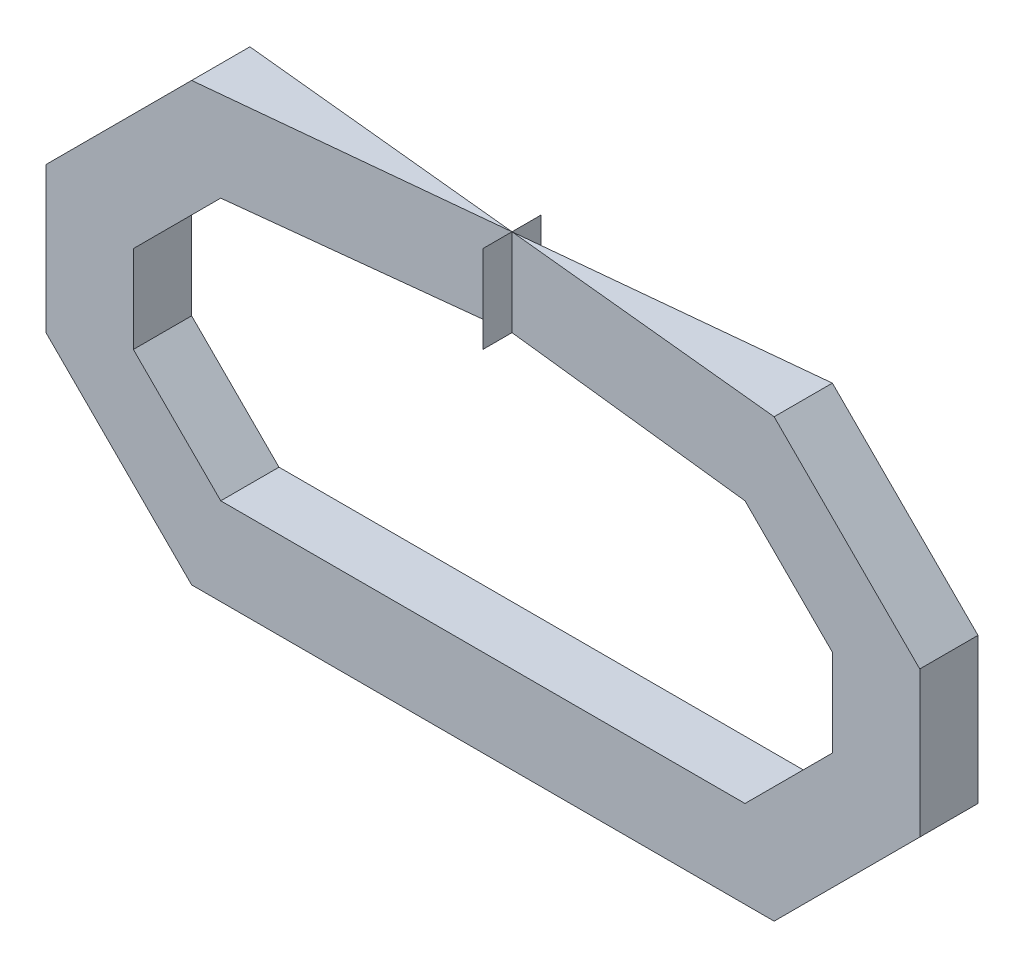
ISO-10303-21;
HEADER;
FILE_DESCRIPTION(('STEP AP214'),'2;1');
FILE_NAME('part.step','',(''),(''),'','','');
FILE_SCHEMA(('AUTOMOTIVE_DESIGN { 1 0 10303 214 1 1 1 1 }'));
ENDSEC;
DATA;
#1=APPLICATION_CONTEXT('core data for automotive mechanical design processes');
#2=APPLICATION_PROTOCOL_DEFINITION('international standard','automotive_design',2000,#1);
#3=PRODUCT_CONTEXT('',#1,'mechanical');
#4=PRODUCT('Part','Part','',(#3));
#5=PRODUCT_RELATED_PRODUCT_CATEGORY('part','',(#4));
#6=PRODUCT_DEFINITION_FORMATION('','',#4);
#7=PRODUCT_DEFINITION_CONTEXT('part definition',#1,'design');
#8=PRODUCT_DEFINITION('design','',#6,#7);
#9=PRODUCT_DEFINITION_SHAPE('','',#8);
#10=(LENGTH_UNIT() NAMED_UNIT(*) SI_UNIT(.MILLI.,.METRE.));
#11=(NAMED_UNIT(*) PLANE_ANGLE_UNIT() SI_UNIT($,.RADIAN.));
#12=(NAMED_UNIT(*) SI_UNIT($,.STERADIAN.) SOLID_ANGLE_UNIT());
#13=UNCERTAINTY_MEASURE_WITH_UNIT(LENGTH_MEASURE(1.E-05),#10,'distance_accuracy_value','');
#14=(GEOMETRIC_REPRESENTATION_CONTEXT(3) GLOBAL_UNCERTAINTY_ASSIGNED_CONTEXT((#13)) GLOBAL_UNIT_ASSIGNED_CONTEXT((#10,
#11,#12)) REPRESENTATION_CONTEXT('',''));
#15=CARTESIAN_POINT('',(0.,0.,0.));
#16=DIRECTION('',(0.,0.,1.));
#17=DIRECTION('',(1.,0.,0.));
#18=AXIS2_PLACEMENT_3D('',#15,#16,#17);
#19=CARTESIAN_POINT('',(-0.127,-0.09524999999999,0.0254));
#20=DIRECTION('',(0.,0.,1.));
#21=DIRECTION('',(1.,0.,0.));
#22=AXIS2_PLACEMENT_3D('',#19,#20,#21);
#23=PLANE('',#22);
#24=DIRECTION('',(0.,1.,0.));
#25=VECTOR('',#24,1.);
#26=CARTESIAN_POINT('',(0.1905,0.03175000000002,0.0254));
#27=LINE('',#26,#25);
#28=CARTESIAN_POINT('',(0.1905,0.03175000000002,0.0254));
#29=VERTEX_POINT('',#28);
#30=CARTESIAN_POINT('',(0.1905,-0.03174999999999,0.0254));
#31=VERTEX_POINT('',#30);
#32=EDGE_CURVE('P0_E218',#29,#31,#27,.F.);
#33=ORIENTED_EDGE('',*,*,#32,.F.);
#34=DIRECTION('',(-0.707106781186548,0.707106781186548,0.));
#35=VECTOR('',#34,1.);
#36=CARTESIAN_POINT('',(0.127,0.09525000000002,0.0254));
#37=LINE('',#36,#35);
#38=CARTESIAN_POINT('',(0.127,0.09525000000002,0.0254));
#39=VERTEX_POINT('',#38);
#40=EDGE_CURVE('P0_E215',#39,#29,#37,.F.);
#41=ORIENTED_EDGE('',*,*,#40,.F.);
#42=DIRECTION('',(1.,0.,0.));
#43=VECTOR('',#42,1.);
#44=CARTESIAN_POINT('',(0.,0.09525000000002,0.0254));
#45=LINE('',#44,#43);
#46=CARTESIAN_POINT('',(0.,0.09525000000002,0.0127));
#47=VERTEX_POINT('',#46);
#48=EDGE_CURVE('P0_E239',#47,#39,#45,.T.);
#49=ORIENTED_EDGE('',*,*,#48,.F.);
#50=DIRECTION('',(1.,0.,0.));
#51=VECTOR('',#50,1.);
#52=CARTESIAN_POINT('',(-0.127,0.09525000000002,0.0254));
#53=LINE('',#52,#51);
#54=CARTESIAN_POINT('',(-0.127,0.09525000000002,0.0254));
#55=VERTEX_POINT('',#54);
#56=EDGE_CURVE('P0_E236',#55,#47,#53,.T.);
#57=ORIENTED_EDGE('',*,*,#56,.F.);
#58=DIRECTION('',(-0.707106781186548,-0.707106781186548,0.));
#59=VECTOR('',#58,1.);
#60=CARTESIAN_POINT('',(-0.1905,0.03175000000002,0.0254));
#61=LINE('',#60,#59);
#62=CARTESIAN_POINT('',(-0.1905,0.03175000000002,0.0254));
#63=VERTEX_POINT('',#62);
#64=EDGE_CURVE('P0_E234',#63,#55,#61,.F.);
#65=ORIENTED_EDGE('',*,*,#64,.F.);
#66=DIRECTION('',(0.,1.,0.));
#67=VECTOR('',#66,1.);
#68=CARTESIAN_POINT('',(-0.1905,-0.03174999999999,0.0254));
#69=LINE('',#68,#67);
#70=CARTESIAN_POINT('',(-0.1905,-0.03174999999999,0.0254));
#71=VERTEX_POINT('',#70);
#72=EDGE_CURVE('P0_E231',#71,#63,#69,.T.);
#73=ORIENTED_EDGE('',*,*,#72,.F.);
#74=DIRECTION('',(0.707106781186548,-0.707106781186548,0.));
#75=VECTOR('',#74,1.);
#76=CARTESIAN_POINT('',(-0.127,-0.09524999999999,0.0254));
#77=LINE('',#76,#75);
#78=CARTESIAN_POINT('',(-0.127,-0.09524999999999,0.0254));
#79=VERTEX_POINT('',#78);
#80=EDGE_CURVE('P0_E228',#79,#71,#77,.F.);
#81=ORIENTED_EDGE('',*,*,#80,.F.);
#82=DIRECTION('',(1.,0.,0.));
#83=VECTOR('',#82,1.);
#84=CARTESIAN_POINT('',(0.127,-0.09524999999999,0.0254));
#85=LINE('',#84,#83);
#86=CARTESIAN_POINT('',(0.127,-0.09524999999999,0.0254));
#87=VERTEX_POINT('',#86);
#88=EDGE_CURVE('P0_E225',#87,#79,#85,.F.);
#89=ORIENTED_EDGE('',*,*,#88,.F.);
#90=DIRECTION('',(0.707106781186548,0.707106781186548,0.));
#91=VECTOR('',#90,1.);
#92=CARTESIAN_POINT('',(0.1905,-0.03174999999999,0.0254));
#93=LINE('',#92,#91);
#94=EDGE_CURVE('P0_E222',#31,#87,#93,.F.);
#95=ORIENTED_EDGE('',*,*,#94,.F.);
#96=EDGE_LOOP('',(#33,#41,#49,#57,#65,#73,#81,#89,#95));
#97=FACE_BOUND('',#96,.T.);
#98=DIRECTION('',(0.707106781187048,0.707106781186048,0.));
#99=VECTOR('',#98,1.);
#100=CARTESIAN_POINT('',(-0.1143,0.05715000000001,0.0254));
#101=LINE('',#100,#99);
#102=CARTESIAN_POINT('',(-0.1143,0.05715000000001,0.0254));
#103=VERTEX_POINT('',#102);
#104=CARTESIAN_POINT('',(-0.152400000000011,0.0190500000000529,0.0254));
#105=VERTEX_POINT('',#104);
#106=EDGE_CURVE('P0_E250',#103,#105,#101,.F.);
#107=ORIENTED_EDGE('',*,*,#106,.F.);
#108=DIRECTION('',(1.,0.,0.));
#109=VECTOR('',#108,1.);
#110=CARTESIAN_POINT('',(0.,0.05715000000001,0.0254));
#111=LINE('',#110,#109);
#112=CARTESIAN_POINT('',(0.,0.05715000000001,0.0127));
#113=VERTEX_POINT('',#112);
#114=EDGE_CURVE('P0_E149',#113,#103,#111,.F.);
#115=ORIENTED_EDGE('',*,*,#114,.F.);
#116=DIRECTION('',(1.,0.,0.));
#117=VECTOR('',#116,1.);
#118=CARTESIAN_POINT('',(0.1143,0.05715000000001,0.0254));
#119=LINE('',#118,#117);
#120=CARTESIAN_POINT('',(0.114299999999967,0.057149999999999,0.0254));
#121=VERTEX_POINT('',#120);
#122=EDGE_CURVE('P0_E144',#121,#113,#119,.F.);
#123=ORIENTED_EDGE('',*,*,#122,.F.);
#124=DIRECTION('',(0.707106781187048,-0.707106781186048,0.));
#125=VECTOR('',#124,1.);
#126=CARTESIAN_POINT('',(0.1524,0.01905000000002,0.0254));
#127=LINE('',#126,#125);
#128=CARTESIAN_POINT('',(0.1524,0.01905000000002,0.0254));
#129=VERTEX_POINT('',#128);
#130=EDGE_CURVE('P0_E135',#129,#121,#127,.F.);
#131=ORIENTED_EDGE('',*,*,#130,.F.);
#132=DIRECTION('',(0.,1.,0.));
#133=VECTOR('',#132,1.);
#134=CARTESIAN_POINT('',(0.1524,-0.01904999999999,0.0254));
#135=LINE('',#134,#133);
#136=CARTESIAN_POINT('',(0.152400000000011,-0.0190500000000229,0.0254));
#137=VERTEX_POINT('',#136);
#138=EDGE_CURVE('P0_E130',#137,#129,#135,.T.);
#139=ORIENTED_EDGE('',*,*,#138,.F.);
#140=DIRECTION('',(-0.707106781187048,-0.707106781186048,0.));
#141=VECTOR('',#140,1.);
#142=CARTESIAN_POINT('',(0.1143,-0.05714999999998,0.0254));
#143=LINE('',#142,#141);
#144=CARTESIAN_POINT('',(0.1143,-0.05714999999998,0.0254));
#145=VERTEX_POINT('',#144);
#146=EDGE_CURVE('P0_E262',#145,#137,#143,.F.);
#147=ORIENTED_EDGE('',*,*,#146,.F.);
#148=DIRECTION('',(1.,0.,0.));
#149=VECTOR('',#148,1.);
#150=CARTESIAN_POINT('',(-0.1143,-0.05714999999998,0.0254));
#151=LINE('',#150,#149);
#152=CARTESIAN_POINT('',(-0.114299999999967,-0.057149999999969,0.0254));
#153=VERTEX_POINT('',#152);
#154=EDGE_CURVE('P0_E259',#153,#145,#151,.T.);
#155=ORIENTED_EDGE('',*,*,#154,.F.);
#156=DIRECTION('',(-0.707106781187048,0.707106781186048,0.));
#157=VECTOR('',#156,1.);
#158=CARTESIAN_POINT('',(-0.1524,-0.01904999999999,0.0254));
#159=LINE('',#158,#157);
#160=CARTESIAN_POINT('',(-0.1524,-0.01904999999999,0.0254));
#161=VERTEX_POINT('',#160);
#162=EDGE_CURVE('P0_E256',#161,#153,#159,.F.);
#163=ORIENTED_EDGE('',*,*,#162,.F.);
#164=DIRECTION('',(0.,1.,0.));
#165=VECTOR('',#164,1.);
#166=CARTESIAN_POINT('',(-0.1524,0.01905000000002,0.0254));
#167=LINE('',#166,#165);
#168=EDGE_CURVE('P0_E253',#105,#161,#167,.F.);
#169=ORIENTED_EDGE('',*,*,#168,.F.);
#170=EDGE_LOOP('',(#107,#115,#123,#131,#139,#147,#155,#163,#169));
#171=FACE_BOUND('',#170,.T.);
#172=ADVANCED_FACE('P0_F17',(#97,#171),#23,.T.);
#173=CARTESIAN_POINT('',(0.1143,0.05715000000001,0.));
#174=DIRECTION('',(0.,-1.,0.));
#175=DIRECTION('',(0.,0.,-1.));
#176=AXIS2_PLACEMENT_3D('',#173,#174,#175);
#177=PLANE('',#176);
#178=DIRECTION('',(1.,0.,0.));
#179=VECTOR('',#178,1.);
#180=CARTESIAN_POINT('',(0.1143,0.05715000000001,0.));
#181=LINE('',#180,#179);
#182=CARTESIAN_POINT('',(0.114299999999967,0.057149999999999,0.));
#183=VERTEX_POINT('',#182);
#184=EDGE_CURVE('P0_E154',#113,#183,#181,.T.);
#185=ORIENTED_EDGE('',*,*,#184,.T.);
#186=DIRECTION('',(0.,0.,1.));
#187=VECTOR('',#186,1.);
#188=CARTESIAN_POINT('',(0.114299999999978,0.0571499999999881,0.));
#189=LINE('',#188,#187);
#190=EDGE_CURVE('P0_E140',#121,#183,#189,.F.);
#191=ORIENTED_EDGE('',*,*,#190,.F.);
#192=ORIENTED_EDGE('',*,*,#122,.T.);
#193=EDGE_LOOP('',(#185,#191,#192));
#194=FACE_BOUND('',#193,.T.);
#195=ADVANCED_FACE('P0_F153',(#194),#177,.T.);
#196=CARTESIAN_POINT('',(0.1524,0.01905000000002,0.));
#197=DIRECTION('',(-0.707106781186048,-0.707106781187048,0.));
#198=DIRECTION('',(0.707106781187048,-0.707106781186048,0.));
#199=AXIS2_PLACEMENT_3D('',#196,#197,#198);
#200=PLANE('',#199);
#201=ORIENTED_EDGE('',*,*,#190,.T.);
#202=DIRECTION('',(0.707106781187048,-0.707106781186048,0.));
#203=VECTOR('',#202,1.);
#204=CARTESIAN_POINT('',(0.1524,0.01905000000002,0.));
#205=LINE('',#204,#203);
#206=CARTESIAN_POINT('',(0.1524,0.01905000000002,0.));
#207=VERTEX_POINT('',#206);
#208=EDGE_CURVE('P0_E210',#183,#207,#205,.T.);
#209=ORIENTED_EDGE('',*,*,#208,.T.);
#210=DIRECTION('',(0.,0.,1.));
#211=VECTOR('',#210,1.);
#212=CARTESIAN_POINT('',(0.1524,0.01905000000002,0.));
#213=LINE('',#212,#211);
#214=EDGE_CURVE('P0_E142',#129,#207,#213,.F.);
#215=ORIENTED_EDGE('',*,*,#214,.F.);
#216=ORIENTED_EDGE('',*,*,#130,.T.);
#217=EDGE_LOOP('',(#201,#209,#215,#216));
#218=FACE_BOUND('',#217,.T.);
#219=ADVANCED_FACE('P0_F137',(#218),#200,.T.);
#220=CARTESIAN_POINT('',(0.1524,-0.01904999999999,0.));
#221=DIRECTION('',(-1.,0.,0.));
#222=DIRECTION('',(0.,0.,1.));
#223=AXIS2_PLACEMENT_3D('',#220,#221,#222);
#224=PLANE('',#223);
#225=ORIENTED_EDGE('',*,*,#214,.T.);
#226=DIRECTION('',(0.,1.,0.));
#227=VECTOR('',#226,1.);
#228=CARTESIAN_POINT('',(0.1524,-0.01904999999999,0.));
#229=LINE('',#228,#227);
#230=CARTESIAN_POINT('',(0.152400000000011,-0.0190500000000229,0.));
#231=VERTEX_POINT('',#230);
#232=EDGE_CURVE('P0_E207',#207,#231,#229,.F.);
#233=ORIENTED_EDGE('',*,*,#232,.T.);
#234=DIRECTION('',(0.,0.,1.));
#235=VECTOR('',#234,1.);
#236=CARTESIAN_POINT('',(0.152400000000022,-0.0190500000000119,0.));
#237=LINE('',#236,#235);
#238=EDGE_CURVE('P0_E261',#137,#231,#237,.F.);
#239=ORIENTED_EDGE('',*,*,#238,.F.);
#240=ORIENTED_EDGE('',*,*,#138,.T.);
#241=EDGE_LOOP('',(#225,#233,#239,#240));
#242=FACE_BOUND('',#241,.T.);
#243=ADVANCED_FACE('P0_F267',(#242),#224,.T.);
#244=CARTESIAN_POINT('',(0.1143,-0.05714999999998,0.));
#245=DIRECTION('',(-0.707106781186048,0.707106781187048,0.));
#246=DIRECTION('',(-0.707106781187048,-0.707106781186048,0.));
#247=AXIS2_PLACEMENT_3D('',#244,#245,#246);
#248=PLANE('',#247);
#249=ORIENTED_EDGE('',*,*,#238,.T.);
#250=DIRECTION('',(-0.707106781187048,-0.707106781186048,0.));
#251=VECTOR('',#250,1.);
#252=CARTESIAN_POINT('',(0.1143,-0.05714999999998,0.));
#253=LINE('',#252,#251);
#254=CARTESIAN_POINT('',(0.1143,-0.05714999999998,0.));
#255=VERTEX_POINT('',#254);
#256=EDGE_CURVE('P0_E204',#231,#255,#253,.T.);
#257=ORIENTED_EDGE('',*,*,#256,.T.);
#258=DIRECTION('',(0.,0.,1.));
#259=VECTOR('',#258,1.);
#260=CARTESIAN_POINT('',(0.1143,-0.05714999999998,0.));
#261=LINE('',#260,#259);
#262=EDGE_CURVE('P0_E258',#145,#255,#261,.F.);
#263=ORIENTED_EDGE('',*,*,#262,.F.);
#264=ORIENTED_EDGE('',*,*,#146,.T.);
#265=EDGE_LOOP('',(#249,#257,#263,#264));
#266=FACE_BOUND('',#265,.T.);
#267=ADVANCED_FACE('P0_F274',(#266),#248,.T.);
#268=CARTESIAN_POINT('',(-0.1143,-0.05714999999998,0.));
#269=DIRECTION('',(0.,1.,0.));
#270=DIRECTION('',(0.,0.,1.));
#271=AXIS2_PLACEMENT_3D('',#268,#269,#270);
#272=PLANE('',#271);
#273=ORIENTED_EDGE('',*,*,#262,.T.);
#274=DIRECTION('',(1.,0.,0.));
#275=VECTOR('',#274,1.);
#276=CARTESIAN_POINT('',(-0.1143,-0.05714999999998,0.));
#277=LINE('',#276,#275);
#278=CARTESIAN_POINT('',(-0.114299999999967,-0.057149999999969,0.));
#279=VERTEX_POINT('',#278);
#280=EDGE_CURVE('P0_E201',#255,#279,#277,.F.);
#281=ORIENTED_EDGE('',*,*,#280,.T.);
#282=DIRECTION('',(0.,0.,1.));
#283=VECTOR('',#282,1.);
#284=CARTESIAN_POINT('',(-0.114299999999978,-0.0571499999999581,0.));
#285=LINE('',#284,#283);
#286=EDGE_CURVE('P0_E255',#153,#279,#285,.F.);
#287=ORIENTED_EDGE('',*,*,#286,.F.);
#288=ORIENTED_EDGE('',*,*,#154,.T.);
#289=EDGE_LOOP('',(#273,#281,#287,#288));
#290=FACE_BOUND('',#289,.T.);
#291=ADVANCED_FACE('P0_F454',(#290),#272,.T.);
#292=CARTESIAN_POINT('',(-0.1524,-0.01904999999999,0.));
#293=DIRECTION('',(0.707106781186048,0.707106781187048,0.));
#294=DIRECTION('',(-0.707106781187048,0.707106781186048,0.));
#295=AXIS2_PLACEMENT_3D('',#292,#293,#294);
#296=PLANE('',#295);
#297=ORIENTED_EDGE('',*,*,#286,.T.);
#298=DIRECTION('',(-0.707106781187048,0.707106781186048,0.));
#299=VECTOR('',#298,1.);
#300=CARTESIAN_POINT('',(-0.1524,-0.01904999999999,0.));
#301=LINE('',#300,#299);
#302=CARTESIAN_POINT('',(-0.1524,-0.01904999999999,0.));
#303=VERTEX_POINT('',#302);
#304=EDGE_CURVE('P0_E198',#279,#303,#301,.T.);
#305=ORIENTED_EDGE('',*,*,#304,.T.);
#306=DIRECTION('',(0.,0.,-1.));
#307=VECTOR('',#306,1.);
#308=CARTESIAN_POINT('',(-0.1524,-0.01904999999999,0.));
#309=LINE('',#308,#307);
#310=EDGE_CURVE('P0_E252',#161,#303,#309,.T.);
#311=ORIENTED_EDGE('',*,*,#310,.F.);
#312=ORIENTED_EDGE('',*,*,#162,.T.);
#313=EDGE_LOOP('',(#297,#305,#311,#312));
#314=FACE_BOUND('',#313,.T.);
#315=ADVANCED_FACE('P0_F445',(#314),#296,.T.);
#316=CARTESIAN_POINT('',(-0.1524,0.01905000000002,0.));
#317=DIRECTION('',(1.,0.,0.));
#318=DIRECTION('',(0.,0.,-1.));
#319=AXIS2_PLACEMENT_3D('',#316,#317,#318);
#320=PLANE('',#319);
#321=ORIENTED_EDGE('',*,*,#310,.T.);
#322=DIRECTION('',(0.,1.,0.));
#323=VECTOR('',#322,1.);
#324=CARTESIAN_POINT('',(-0.1524,0.01905000000002,0.));
#325=LINE('',#324,#323);
#326=CARTESIAN_POINT('',(-0.152400000000011,0.0190500000000529,0.));
#327=VERTEX_POINT('',#326);
#328=EDGE_CURVE('P0_E195',#303,#327,#325,.T.);
#329=ORIENTED_EDGE('',*,*,#328,.T.);
#330=DIRECTION('',(0.,0.,1.));
#331=VECTOR('',#330,1.);
#332=CARTESIAN_POINT('',(-0.152400000000022,0.0190500000000419,0.));
#333=LINE('',#332,#331);
#334=EDGE_CURVE('P0_E247',#105,#327,#333,.F.);
#335=ORIENTED_EDGE('',*,*,#334,.F.);
#336=ORIENTED_EDGE('',*,*,#168,.T.);
#337=EDGE_LOOP('',(#321,#329,#335,#336));
#338=FACE_BOUND('',#337,.T.);
#339=ADVANCED_FACE('P0_F436',(#338),#320,.T.);
#340=CARTESIAN_POINT('',(-0.1143,0.05715000000001,0.));
#341=DIRECTION('',(0.707106781186048,-0.707106781187048,0.));
#342=DIRECTION('',(0.707106781187048,0.707106781186048,0.));
#343=AXIS2_PLACEMENT_3D('',#340,#341,#342);
#344=PLANE('',#343);
#345=ORIENTED_EDGE('',*,*,#334,.T.);
#346=DIRECTION('',(0.707106781187048,0.707106781186048,0.));
#347=VECTOR('',#346,1.);
#348=CARTESIAN_POINT('',(-0.1143,0.05715000000001,0.));
#349=LINE('',#348,#347);
#350=CARTESIAN_POINT('',(-0.1143,0.05715000000001,0.));
#351=VERTEX_POINT('',#350);
#352=EDGE_CURVE('P0_E190',#327,#351,#349,.T.);
#353=ORIENTED_EDGE('',*,*,#352,.T.);
#354=DIRECTION('',(0.,0.,-1.));
#355=VECTOR('',#354,1.);
#356=CARTESIAN_POINT('',(-0.1143,0.05715000000001,0.));
#357=LINE('',#356,#355);
#358=EDGE_CURVE('P0_E243',#103,#351,#357,.T.);
#359=ORIENTED_EDGE('',*,*,#358,.F.);
#360=ORIENTED_EDGE('',*,*,#106,.T.);
#361=EDGE_LOOP('',(#345,#353,#359,#360));
#362=FACE_BOUND('',#361,.T.);
#363=ADVANCED_FACE('P0_F341',(#362),#344,.T.);
#364=CARTESIAN_POINT('',(0.,0.05715000000001,0.));
#365=DIRECTION('',(0.,-1.,0.));
#366=DIRECTION('',(0.,0.,-1.));
#367=AXIS2_PLACEMENT_3D('',#364,#365,#366);
#368=PLANE('',#367);
#369=ORIENTED_EDGE('',*,*,#358,.T.);
#370=DIRECTION('',(1.,0.,0.));
#371=VECTOR('',#370,1.);
#372=CARTESIAN_POINT('',(0.,0.05715000000001,0.));
#373=LINE('',#372,#371);
#374=EDGE_CURVE('P0_E185',#351,#113,#373,.T.);
#375=ORIENTED_EDGE('',*,*,#374,.T.);
#376=ORIENTED_EDGE('',*,*,#114,.T.);
#377=EDGE_LOOP('',(#369,#375,#376));
#378=FACE_BOUND('',#377,.T.);
#379=ADVANCED_FACE('P0_F333',(#378),#368,.T.);
#380=CARTESIAN_POINT('',(0.,0.09525000000002,0.));
#381=DIRECTION('',(0.,1.,0.));
#382=DIRECTION('',(0.,0.,1.));
#383=AXIS2_PLACEMENT_3D('',#380,#381,#382);
#384=PLANE('',#383);
#385=DIRECTION('',(0.,0.,1.));
#386=VECTOR('',#385,1.);
#387=CARTESIAN_POINT('',(0.127,0.09525000000002,0.));
#388=LINE('',#387,#386);
#389=CARTESIAN_POINT('',(0.127,0.09525000000002,0.));
#390=VERTEX_POINT('',#389);
#391=EDGE_CURVE('P0_E217',#390,#39,#388,.T.);
#392=ORIENTED_EDGE('',*,*,#391,.F.);
#393=DIRECTION('',(1.,0.,0.));
#394=VECTOR('',#393,1.);
#395=CARTESIAN_POINT('',(0.,0.09525000000002,0.));
#396=LINE('',#395,#394);
#397=EDGE_CURVE('P0_E180',#390,#47,#396,.F.);
#398=ORIENTED_EDGE('',*,*,#397,.T.);
#399=ORIENTED_EDGE('',*,*,#48,.T.);
#400=EDGE_LOOP('',(#392,#398,#399));
#401=FACE_BOUND('',#400,.T.);
#402=ADVANCED_FACE('P0_F331',(#401),#384,.T.);
#403=CARTESIAN_POINT('',(-0.127,0.09525000000002,0.));
#404=DIRECTION('',(0.,1.,0.));
#405=DIRECTION('',(0.,0.,1.));
#406=AXIS2_PLACEMENT_3D('',#403,#404,#405);
#407=PLANE('',#406);
#408=DIRECTION('',(1.,0.,0.));
#409=VECTOR('',#408,1.);
#410=CARTESIAN_POINT('',(-0.127,0.09525000000002,0.));
#411=LINE('',#410,#409);
#412=CARTESIAN_POINT('',(-0.127,0.09525000000002,0.));
#413=VERTEX_POINT('',#412);
#414=EDGE_CURVE('P0_E177',#47,#413,#411,.F.);
#415=ORIENTED_EDGE('',*,*,#414,.T.);
#416=DIRECTION('',(0.,0.,1.));
#417=VECTOR('',#416,1.);
#418=CARTESIAN_POINT('',(-0.127,0.09525000000002,0.));
#419=LINE('',#418,#417);
#420=EDGE_CURVE('P0_E233',#55,#413,#419,.F.);
#421=ORIENTED_EDGE('',*,*,#420,.F.);
#422=ORIENTED_EDGE('',*,*,#56,.T.);
#423=EDGE_LOOP('',(#415,#421,#422));
#424=FACE_BOUND('',#423,.T.);
#425=ADVANCED_FACE('P0_F330',(#424),#407,.T.);
#426=CARTESIAN_POINT('',(-0.1905,0.03175000000002,0.));
#427=DIRECTION('',(-0.707106781186548,0.707106781186548,0.));
#428=DIRECTION('',(-0.707106781186548,-0.707106781186548,0.));
#429=AXIS2_PLACEMENT_3D('',#426,#427,#428);
#430=PLANE('',#429);
#431=ORIENTED_EDGE('',*,*,#420,.T.);
#432=DIRECTION('',(-0.707106781186548,-0.707106781186548,0.));
#433=VECTOR('',#432,1.);
#434=CARTESIAN_POINT('',(-0.1905,0.03175000000002,0.));
#435=LINE('',#434,#433);
#436=CARTESIAN_POINT('',(-0.1905,0.03175000000002,0.));
#437=VERTEX_POINT('',#436);
#438=EDGE_CURVE('P0_E174',#413,#437,#435,.T.);
#439=ORIENTED_EDGE('',*,*,#438,.T.);
#440=DIRECTION('',(0.,0.,1.));
#441=VECTOR('',#440,1.);
#442=CARTESIAN_POINT('',(-0.1905,0.03175000000002,0.));
#443=LINE('',#442,#441);
#444=EDGE_CURVE('P0_E230',#63,#437,#443,.F.);
#445=ORIENTED_EDGE('',*,*,#444,.F.);
#446=ORIENTED_EDGE('',*,*,#64,.T.);
#447=EDGE_LOOP('',(#431,#439,#445,#446));
#448=FACE_BOUND('',#447,.T.);
#449=ADVANCED_FACE('P0_F327',(#448),#430,.T.);
#450=CARTESIAN_POINT('',(-0.1905,-0.03174999999999,0.));
#451=DIRECTION('',(-1.,0.,0.));
#452=DIRECTION('',(0.,0.,1.));
#453=AXIS2_PLACEMENT_3D('',#450,#451,#452);
#454=PLANE('',#453);
#455=ORIENTED_EDGE('',*,*,#444,.T.);
#456=DIRECTION('',(0.,1.,0.));
#457=VECTOR('',#456,1.);
#458=CARTESIAN_POINT('',(-0.1905,-0.03174999999999,0.));
#459=LINE('',#458,#457);
#460=CARTESIAN_POINT('',(-0.1905,-0.03174999999999,0.));
#461=VERTEX_POINT('',#460);
#462=EDGE_CURVE('P0_E171',#437,#461,#459,.F.);
#463=ORIENTED_EDGE('',*,*,#462,.T.);
#464=DIRECTION('',(0.,0.,1.));
#465=VECTOR('',#464,1.);
#466=CARTESIAN_POINT('',(-0.1905,-0.03174999999999,0.));
#467=LINE('',#466,#465);
#468=EDGE_CURVE('P0_E227',#71,#461,#467,.F.);
#469=ORIENTED_EDGE('',*,*,#468,.F.);
#470=ORIENTED_EDGE('',*,*,#72,.T.);
#471=EDGE_LOOP('',(#455,#463,#469,#470));
#472=FACE_BOUND('',#471,.T.);
#473=ADVANCED_FACE('P0_F322',(#472),#454,.T.);
#474=CARTESIAN_POINT('',(-0.127,-0.09524999999999,0.));
#475=DIRECTION('',(-0.707106781186548,-0.707106781186548,0.));
#476=DIRECTION('',(0.707106781186548,-0.707106781186548,0.));
#477=AXIS2_PLACEMENT_3D('',#474,#475,#476);
#478=PLANE('',#477);
#479=ORIENTED_EDGE('',*,*,#468,.T.);
#480=DIRECTION('',(0.707106781186548,-0.707106781186548,0.));
#481=VECTOR('',#480,1.);
#482=CARTESIAN_POINT('',(-0.127,-0.09524999999999,0.));
#483=LINE('',#482,#481);
#484=CARTESIAN_POINT('',(-0.127,-0.09524999999999,0.));
#485=VERTEX_POINT('',#484);
#486=EDGE_CURVE('P0_E168',#461,#485,#483,.T.);
#487=ORIENTED_EDGE('',*,*,#486,.T.);
#488=DIRECTION('',(0.,0.,-1.));
#489=VECTOR('',#488,1.);
#490=CARTESIAN_POINT('',(-0.127,-0.09524999999999,0.));
#491=LINE('',#490,#489);
#492=EDGE_CURVE('P0_E224',#79,#485,#491,.T.);
#493=ORIENTED_EDGE('',*,*,#492,.F.);
#494=ORIENTED_EDGE('',*,*,#80,.T.);
#495=EDGE_LOOP('',(#479,#487,#493,#494));
#496=FACE_BOUND('',#495,.T.);
#497=ADVANCED_FACE('P0_F318',(#496),#478,.T.);
#498=CARTESIAN_POINT('',(0.127,-0.09524999999999,0.));
#499=DIRECTION('',(0.,-1.,0.));
#500=DIRECTION('',(0.,0.,-1.));
#501=AXIS2_PLACEMENT_3D('',#498,#499,#500);
#502=PLANE('',#501);
#503=ORIENTED_EDGE('',*,*,#492,.T.);
#504=DIRECTION('',(1.,0.,0.));
#505=VECTOR('',#504,1.);
#506=CARTESIAN_POINT('',(0.127,-0.09524999999999,0.));
#507=LINE('',#506,#505);
#508=CARTESIAN_POINT('',(0.127,-0.09524999999999,0.));
#509=VERTEX_POINT('',#508);
#510=EDGE_CURVE('P0_E165',#485,#509,#507,.T.);
#511=ORIENTED_EDGE('',*,*,#510,.T.);
#512=DIRECTION('',(0.,0.,1.));
#513=VECTOR('',#512,1.);
#514=CARTESIAN_POINT('',(0.127,-0.09524999999999,0.));
#515=LINE('',#514,#513);
#516=EDGE_CURVE('P0_E221',#87,#509,#515,.F.);
#517=ORIENTED_EDGE('',*,*,#516,.F.);
#518=ORIENTED_EDGE('',*,*,#88,.T.);
#519=EDGE_LOOP('',(#503,#511,#517,#518));
#520=FACE_BOUND('',#519,.T.);
#521=ADVANCED_FACE('P0_F312',(#520),#502,.T.);
#522=CARTESIAN_POINT('',(0.1905,-0.03174999999999,0.));
#523=DIRECTION('',(0.707106781186548,-0.707106781186548,0.));
#524=DIRECTION('',(0.707106781186548,0.707106781186548,0.));
#525=AXIS2_PLACEMENT_3D('',#522,#523,#524);
#526=PLANE('',#525);
#527=ORIENTED_EDGE('',*,*,#516,.T.);
#528=DIRECTION('',(0.707106781186548,0.707106781186548,0.));
#529=VECTOR('',#528,1.);
#530=CARTESIAN_POINT('',(0.1905,-0.03174999999999,0.));
#531=LINE('',#530,#529);
#532=CARTESIAN_POINT('',(0.1905,-0.03174999999999,0.));
#533=VERTEX_POINT('',#532);
#534=EDGE_CURVE('P0_E162',#509,#533,#531,.T.);
#535=ORIENTED_EDGE('',*,*,#534,.T.);
#536=DIRECTION('',(0.,0.,-1.));
#537=VECTOR('',#536,1.);
#538=CARTESIAN_POINT('',(0.1905,-0.03174999999999,0.));
#539=LINE('',#538,#537);
#540=EDGE_CURVE('P0_E220',#31,#533,#539,.T.);
#541=ORIENTED_EDGE('',*,*,#540,.F.);
#542=ORIENTED_EDGE('',*,*,#94,.T.);
#543=EDGE_LOOP('',(#527,#535,#541,#542));
#544=FACE_BOUND('',#543,.T.);
#545=ADVANCED_FACE('P0_F309',(#544),#526,.T.);
#546=CARTESIAN_POINT('',(0.1905,0.03175000000002,0.));
#547=DIRECTION('',(1.,0.,0.));
#548=DIRECTION('',(0.,0.,-1.));
#549=AXIS2_PLACEMENT_3D('',#546,#547,#548);
#550=PLANE('',#549);
#551=ORIENTED_EDGE('',*,*,#540,.T.);
#552=DIRECTION('',(0.,1.,0.));
#553=VECTOR('',#552,1.);
#554=CARTESIAN_POINT('',(0.1905,0.03175000000002,0.));
#555=LINE('',#554,#553);
#556=CARTESIAN_POINT('',(0.1905,0.03175000000002,0.));
#557=VERTEX_POINT('',#556);
#558=EDGE_CURVE('P0_E26',#533,#557,#555,.T.);
#559=ORIENTED_EDGE('',*,*,#558,.T.);
#560=DIRECTION('',(0.,0.,1.));
#561=VECTOR('',#560,1.);
#562=CARTESIAN_POINT('',(0.1905,0.03175000000002,0.));
#563=LINE('',#562,#561);
#564=EDGE_CURVE('P0_E34',#29,#557,#563,.F.);
#565=ORIENTED_EDGE('',*,*,#564,.F.);
#566=ORIENTED_EDGE('',*,*,#32,.T.);
#567=EDGE_LOOP('',(#551,#559,#565,#566));
#568=FACE_BOUND('',#567,.T.);
#569=ADVANCED_FACE('P0_F303',(#568),#550,.T.);
#570=CARTESIAN_POINT('',(0.127,0.09525000000002,0.));
#571=DIRECTION('',(0.707106781186548,0.707106781186548,0.));
#572=DIRECTION('',(-0.707106781186548,0.707106781186548,0.));
#573=AXIS2_PLACEMENT_3D('',#570,#571,#572);
#574=PLANE('',#573);
#575=ORIENTED_EDGE('',*,*,#564,.T.);
#576=DIRECTION('',(-0.707106781186548,0.707106781186548,0.));
#577=VECTOR('',#576,1.);
#578=CARTESIAN_POINT('',(0.127,0.09525000000002,0.));
#579=LINE('',#578,#577);
#580=EDGE_CURVE('P0_E11',#557,#390,#579,.T.);
#581=ORIENTED_EDGE('',*,*,#580,.T.);
#582=ORIENTED_EDGE('',*,*,#391,.T.);
#583=ORIENTED_EDGE('',*,*,#40,.T.);
#584=EDGE_LOOP('',(#575,#581,#582,#583));
#585=FACE_BOUND('',#584,.T.);
#586=ADVANCED_FACE('P0_F292',(#585),#574,.T.);
#587=CARTESIAN_POINT('',(-0.127,-0.09524999999999,0.));
#588=DIRECTION('',(0.,0.,1.));
#589=DIRECTION('',(1.,0.,0.));
#590=AXIS2_PLACEMENT_3D('',#587,#588,#589);
#591=PLANE('',#590);
#592=ORIENTED_EDGE('',*,*,#558,.F.);
#593=ORIENTED_EDGE('',*,*,#534,.F.);
#594=ORIENTED_EDGE('',*,*,#510,.F.);
#595=ORIENTED_EDGE('',*,*,#486,.F.);
#596=ORIENTED_EDGE('',*,*,#462,.F.);
#597=ORIENTED_EDGE('',*,*,#438,.F.);
#598=ORIENTED_EDGE('',*,*,#414,.F.);
#599=ORIENTED_EDGE('',*,*,#397,.F.);
#600=ORIENTED_EDGE('',*,*,#580,.F.);
#601=EDGE_LOOP('',(#592,#593,#594,#595,#596,#597,#598,#599,#600));
#602=FACE_BOUND('',#601,.T.);
#603=ORIENTED_EDGE('',*,*,#352,.F.);
#604=ORIENTED_EDGE('',*,*,#328,.F.);
#605=ORIENTED_EDGE('',*,*,#304,.F.);
#606=ORIENTED_EDGE('',*,*,#280,.F.);
#607=ORIENTED_EDGE('',*,*,#256,.F.);
#608=ORIENTED_EDGE('',*,*,#232,.F.);
#609=ORIENTED_EDGE('',*,*,#208,.F.);
#610=ORIENTED_EDGE('',*,*,#184,.F.);
#611=ORIENTED_EDGE('',*,*,#374,.F.);
#612=EDGE_LOOP('',(#603,#604,#605,#606,#607,#608,#609,#610,#611));
#613=FACE_BOUND('',#612,.T.);
#614=ADVANCED_FACE('P0_F271',(#602,#613),#591,.F.);
#615=CLOSED_SHELL('',(#172,#195,#219,#243,#267,#291,#315,#339,#363,#379,#402,#425,#449,#473,
#497,#521,#545,#569,#586,#614));
#616=MANIFOLD_SOLID_BREP('P0_B1',#615);
#617=CARTESIAN_POINT('',(0.,0.05715000000001,0.));
#618=DIRECTION('',(-1.,0.,0.));
#619=DIRECTION('',(0.,0.,1.));
#620=AXIS2_PLACEMENT_3D('',#617,#618,#619);
#621=PLANE('',#620);
#622=DIRECTION('',(0.,0.,1.));
#623=VECTOR('',#622,1.);
#624=CARTESIAN_POINT('',(0.,0.09525000000002,0.));
#625=LINE('',#624,#623);
#626=CARTESIAN_POINT('',(0.,0.09525000000002,0.0254));
#627=VERTEX_POINT('',#626);
#628=CARTESIAN_POINT('',(0.,0.09525000000002,0.));
#629=VERTEX_POINT('',#628);
#630=EDGE_CURVE('P1_E24',#627,#629,#625,.F.);
#631=ORIENTED_EDGE('',*,*,#630,.T.);
#632=DIRECTION('',(0.,1.,0.));
#633=VECTOR('',#632,1.);
#634=CARTESIAN_POINT('',(0.,0.05715000000001,0.));
#635=LINE('',#634,#633);
#636=CARTESIAN_POINT('',(0.,0.05715000000001,0.));
#637=VERTEX_POINT('',#636);
#638=EDGE_CURVE('P1_E11',#629,#637,#635,.F.);
#639=ORIENTED_EDGE('',*,*,#638,.T.);
#640=DIRECTION('',(0.,0.,1.));
#641=VECTOR('',#640,1.);
#642=CARTESIAN_POINT('',(0.,0.05715000000001,0.));
#643=LINE('',#642,#641);
#644=CARTESIAN_POINT('',(0.,0.05715000000001,0.0254));
#645=VERTEX_POINT('',#644);
#646=EDGE_CURVE('P1_E18',#637,#645,#643,.T.);
#647=ORIENTED_EDGE('',*,*,#646,.T.);
#648=DIRECTION('',(0.,1.,0.));
#649=VECTOR('',#648,1.);
#650=CARTESIAN_POINT('',(0.,0.05715000000001,0.0254));
#651=LINE('',#650,#649);
#652=EDGE_CURVE('P1_E38',#645,#627,#651,.T.);
#653=ORIENTED_EDGE('',*,*,#652,.T.);
#654=EDGE_LOOP('',(#631,#639,#647,#653));
#655=FACE_BOUND('',#654,.T.);
#656=ADVANCED_FACE('P1_F17',(#655),#621,.T.);
#657=OPEN_SHELL('',(#656));
#658=SHELL_BASED_SURFACE_MODEL('P1_B1',(#657));
#659=ADVANCED_BREP_SHAPE_REPRESENTATION('',(#18,#616),#14);
#660=MANIFOLD_SURFACE_SHAPE_REPRESENTATION('',(#18,#658),#14);
#661=SHAPE_REPRESENTATION('',(#18),#14);
#662=SHAPE_DEFINITION_REPRESENTATION(#9,#661);
#663=SHAPE_REPRESENTATION_RELATIONSHIP('','',#661,#659);
#664=SHAPE_REPRESENTATION_RELATIONSHIP('','',#661,#660);
ENDSEC;
END-ISO-10303-21;
